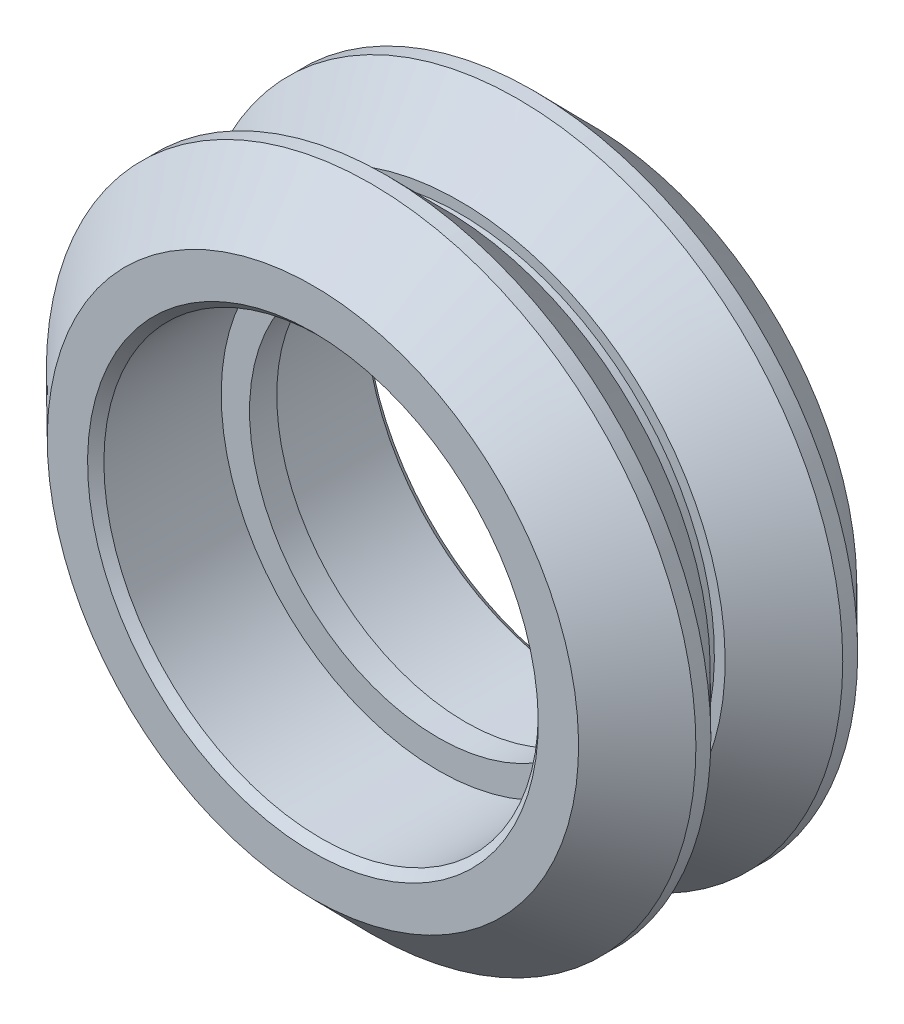
ISO-10303-21;
HEADER;
FILE_DESCRIPTION(('STEP AP214'),'2;1');
FILE_NAME('part.step','',(''),(''),'','','');
FILE_SCHEMA(('AUTOMOTIVE_DESIGN { 1 0 10303 214 1 1 1 1 }'));
ENDSEC;
DATA;
#1=APPLICATION_CONTEXT('core data for automotive mechanical design processes');
#2=APPLICATION_PROTOCOL_DEFINITION('international standard','automotive_design',2000,#1);
#3=PRODUCT_CONTEXT('',#1,'mechanical');
#4=PRODUCT('Part','Part','',(#3));
#5=PRODUCT_RELATED_PRODUCT_CATEGORY('part','',(#4));
#6=PRODUCT_DEFINITION_FORMATION('','',#4);
#7=PRODUCT_DEFINITION_CONTEXT('part definition',#1,'design');
#8=PRODUCT_DEFINITION('design','',#6,#7);
#9=PRODUCT_DEFINITION_SHAPE('','',#8);
#10=(LENGTH_UNIT() NAMED_UNIT(*) SI_UNIT(.MILLI.,.METRE.));
#11=(NAMED_UNIT(*) PLANE_ANGLE_UNIT() SI_UNIT($,.RADIAN.));
#12=(NAMED_UNIT(*) SI_UNIT($,.STERADIAN.) SOLID_ANGLE_UNIT());
#13=UNCERTAINTY_MEASURE_WITH_UNIT(LENGTH_MEASURE(1.E-05),#10,'distance_accuracy_value','');
#14=(GEOMETRIC_REPRESENTATION_CONTEXT(3) GLOBAL_UNCERTAINTY_ASSIGNED_CONTEXT((#13)) GLOBAL_UNIT_ASSIGNED_CONTEXT((#10,
#11,#12)) REPRESENTATION_CONTEXT('',''));
#15=CARTESIAN_POINT('',(0.,0.,0.));
#16=DIRECTION('',(0.,0.,1.));
#17=DIRECTION('',(1.,0.,0.));
#18=AXIS2_PLACEMENT_3D('',#15,#16,#17);
#19=CARTESIAN_POINT('',(0.,0.,5.115));
#20=DIRECTION('',(0.,0.,1.));
#21=DIRECTION('',(0.,-1.,0.));
#22=AXIS2_PLACEMENT_3D('',#19,#20,#21);
#23=CYLINDRICAL_SURFACE('',#22,7.987);
#24=CARTESIAN_POINT('',(0.,0.,4.815));
#25=DIRECTION('',(0.,0.,-1.));
#26=DIRECTION('',(0.,1.,0.));
#27=AXIS2_PLACEMENT_3D('',#24,#25,#26);
#28=CIRCLE('',#27,7.987);
#29=CARTESIAN_POINT('',(0.,7.987,4.815));
#30=VERTEX_POINT('',#29);
#31=EDGE_CURVE('E47',#30,#30,#28,.F.);
#32=ORIENTED_EDGE('',*,*,#31,.T.);
#33=EDGE_LOOP('',(#32));
#34=FACE_BOUND('',#33,.T.);
#35=CARTESIAN_POINT('',(0.,0.,0.499999999999998));
#36=DIRECTION('',(0.,0.,1.));
#37=DIRECTION('',(0.,-1.,0.));
#38=AXIS2_PLACEMENT_3D('',#35,#36,#37);
#39=CIRCLE('',#38,7.987);
#40=CARTESIAN_POINT('',(0.,-7.987,0.499999999999996));
#41=VERTEX_POINT('',#40);
#42=EDGE_CURVE('E91',#41,#41,#39,.T.);
#43=ORIENTED_EDGE('',*,*,#42,.F.);
#44=EDGE_LOOP('',(#43));
#45=FACE_BOUND('',#44,.T.);
#46=ADVANCED_FACE('F32',(#34,#45),#23,.F.);
#47=CARTESIAN_POINT('',(0.,9.77,5.115));
#48=DIRECTION('',(0.,0.,-1.));
#49=DIRECTION('',(0.,1.,0.));
#50=AXIS2_PLACEMENT_3D('',#47,#48,#49);
#51=PLANE('',#50);
#52=CARTESIAN_POINT('',(0.,0.,5.115));
#53=DIRECTION('',(0.,0.,-1.));
#54=DIRECTION('',(0.,1.,0.));
#55=AXIS2_PLACEMENT_3D('',#52,#53,#54);
#56=CIRCLE('',#55,8.287);
#57=CARTESIAN_POINT('',(0.,8.287,5.115));
#58=VERTEX_POINT('',#57);
#59=EDGE_CURVE('E43',#58,#58,#56,.T.);
#60=ORIENTED_EDGE('',*,*,#59,.T.);
#61=EDGE_LOOP('',(#60));
#62=FACE_BOUND('',#61,.T.);
#63=CARTESIAN_POINT('',(0.,0.,5.115));
#64=DIRECTION('',(0.,0.,1.));
#65=DIRECTION('',(0.,-1.,0.));
#66=AXIS2_PLACEMENT_3D('',#63,#64,#65);
#67=CIRCLE('',#66,9.77);
#68=CARTESIAN_POINT('',(0.,-9.77,5.115));
#69=VERTEX_POINT('',#68);
#70=EDGE_CURVE('E52',#69,#69,#67,.T.);
#71=ORIENTED_EDGE('',*,*,#70,.T.);
#72=EDGE_LOOP('',(#71));
#73=FACE_BOUND('',#72,.T.);
#74=ADVANCED_FACE('F98',(#62,#73),#51,.F.);
#75=CARTESIAN_POINT('',(0.,0.,2.975));
#76=DIRECTION('',(0.,0.,-1.));
#77=DIRECTION('',(0.,1.,0.));
#78=AXIS2_PLACEMENT_3D('',#75,#76,#77);
#79=CONICAL_SURFACE('',#78,11.945,0.79350922537995);
#80=ORIENTED_EDGE('',*,*,#70,.F.);
#81=EDGE_LOOP('',(#80));
#82=FACE_BOUND('',#81,.T.);
#83=CARTESIAN_POINT('',(0.,0.,2.975));
#84=DIRECTION('',(0.,0.,1.));
#85=DIRECTION('',(0.,-1.,0.));
#86=AXIS2_PLACEMENT_3D('',#83,#84,#85);
#87=CIRCLE('',#86,11.945);
#88=CARTESIAN_POINT('',(0.,-11.945,2.975));
#89=VERTEX_POINT('',#88);
#90=EDGE_CURVE('E55',#89,#89,#87,.T.);
#91=ORIENTED_EDGE('',*,*,#90,.T.);
#92=EDGE_LOOP('',(#91));
#93=FACE_BOUND('',#92,.T.);
#94=ADVANCED_FACE('F104',(#82,#93),#79,.T.);
#95=CARTESIAN_POINT('',(0.,0.,5.115));
#96=DIRECTION('',(0.,0.,1.));
#97=DIRECTION('',(0.,-1.,0.));
#98=AXIS2_PLACEMENT_3D('',#95,#96,#97);
#99=CYLINDRICAL_SURFACE('',#98,11.945);
#100=ORIENTED_EDGE('',*,*,#90,.F.);
#101=EDGE_LOOP('',(#100));
#102=FACE_BOUND('',#101,.T.);
#103=CARTESIAN_POINT('',(0.,0.,2.425));
#104=DIRECTION('',(0.,0.,1.));
#105=DIRECTION('',(0.,-1.,0.));
#106=AXIS2_PLACEMENT_3D('',#103,#104,#105);
#107=CIRCLE('',#106,11.945);
#108=CARTESIAN_POINT('',(0.,-11.945,2.425));
#109=VERTEX_POINT('',#108);
#110=EDGE_CURVE('E58',#109,#109,#107,.T.);
#111=ORIENTED_EDGE('',*,*,#110,.T.);
#112=EDGE_LOOP('',(#111));
#113=FACE_BOUND('',#112,.T.);
#114=ADVANCED_FACE('F127',(#102,#113),#99,.T.);
#115=CARTESIAN_POINT('',(0.,0.,0.274999999999998));
#116=DIRECTION('',(0.,0.,1.));
#117=DIRECTION('',(0.,-1.,0.));
#118=AXIS2_PLACEMENT_3D('',#115,#116,#117);
#119=CONICAL_SURFACE('',#118,9.77,0.791178445841111);
#120=ORIENTED_EDGE('',*,*,#110,.F.);
#121=EDGE_LOOP('',(#120));
#122=FACE_BOUND('',#121,.T.);
#123=CARTESIAN_POINT('',(0.,0.,0.274999999999998));
#124=DIRECTION('',(0.,0.,1.));
#125=DIRECTION('',(0.,-1.,0.));
#126=AXIS2_PLACEMENT_3D('',#123,#124,#125);
#127=CIRCLE('',#126,9.77);
#128=CARTESIAN_POINT('',(0.,-9.77,0.274999999999997));
#129=VERTEX_POINT('',#128);
#130=EDGE_CURVE('E61',#129,#129,#127,.T.);
#131=ORIENTED_EDGE('',*,*,#130,.T.);
#132=EDGE_LOOP('',(#131));
#133=FACE_BOUND('',#132,.T.);
#134=ADVANCED_FACE('F132',(#122,#133),#119,.T.);
#135=CARTESIAN_POINT('',(0.,9.77,0.275));
#136=DIRECTION('',(0.,0.,1.));
#137=DIRECTION('',(0.,-1.,0.));
#138=AXIS2_PLACEMENT_3D('',#135,#136,#137);
#139=PLANE('',#138);
#140=ORIENTED_EDGE('',*,*,#130,.F.);
#141=EDGE_LOOP('',(#140));
#142=FACE_BOUND('',#141,.T.);
#143=CARTESIAN_POINT('',(0.,0.,0.274999999999998));
#144=DIRECTION('',(0.,0.,1.));
#145=DIRECTION('',(0.,-1.,0.));
#146=AXIS2_PLACEMENT_3D('',#143,#144,#145);
#147=CIRCLE('',#146,9.375);
#148=CARTESIAN_POINT('',(0.,-9.375,0.274999999999997));
#149=VERTEX_POINT('',#148);
#150=EDGE_CURVE('E64',#149,#149,#147,.T.);
#151=ORIENTED_EDGE('',*,*,#150,.T.);
#152=EDGE_LOOP('',(#151));
#153=FACE_BOUND('',#152,.T.);
#154=ADVANCED_FACE('F138',(#142,#153),#139,.F.);
#155=CARTESIAN_POINT('',(0.,0.,5.115));
#156=DIRECTION('',(0.,0.,1.));
#157=DIRECTION('',(0.,-1.,0.));
#158=AXIS2_PLACEMENT_3D('',#155,#156,#157);
#159=CYLINDRICAL_SURFACE('',#158,9.375);
#160=ORIENTED_EDGE('',*,*,#150,.F.);
#161=EDGE_LOOP('',(#160));
#162=FACE_BOUND('',#161,.T.);
#163=CARTESIAN_POINT('',(0.,0.,-0.275000000000002));
#164=DIRECTION('',(0.,0.,1.));
#165=DIRECTION('',(0.,-1.,0.));
#166=AXIS2_PLACEMENT_3D('',#163,#164,#165);
#167=CIRCLE('',#166,9.375);
#168=CARTESIAN_POINT('',(0.,-9.375,-0.275000000000004));
#169=VERTEX_POINT('',#168);
#170=EDGE_CURVE('E67',#169,#169,#167,.T.);
#171=ORIENTED_EDGE('',*,*,#170,.T.);
#172=EDGE_LOOP('',(#171));
#173=FACE_BOUND('',#172,.T.);
#174=ADVANCED_FACE('F144',(#162,#173),#159,.T.);
#175=CARTESIAN_POINT('',(0.,9.77,-0.275));
#176=DIRECTION('',(0.,0.,-1.));
#177=DIRECTION('',(0.,1.,0.));
#178=AXIS2_PLACEMENT_3D('',#175,#176,#177);
#179=PLANE('',#178);
#180=ORIENTED_EDGE('',*,*,#170,.F.);
#181=EDGE_LOOP('',(#180));
#182=FACE_BOUND('',#181,.T.);
#183=CARTESIAN_POINT('',(0.,0.,-0.275000000000002));
#184=DIRECTION('',(0.,0.,1.));
#185=DIRECTION('',(0.,-1.,0.));
#186=AXIS2_PLACEMENT_3D('',#183,#184,#185);
#187=CIRCLE('',#186,9.77);
#188=CARTESIAN_POINT('',(0.,-9.77,-0.275000000000004));
#189=VERTEX_POINT('',#188);
#190=EDGE_CURVE('E70',#189,#189,#187,.T.);
#191=ORIENTED_EDGE('',*,*,#190,.T.);
#192=EDGE_LOOP('',(#191));
#193=FACE_BOUND('',#192,.T.);
#194=ADVANCED_FACE('F150',(#182,#193),#179,.F.);
#195=CARTESIAN_POINT('',(0.,0.,-2.425));
#196=DIRECTION('',(0.,0.,-1.));
#197=DIRECTION('',(0.,1.,0.));
#198=AXIS2_PLACEMENT_3D('',#195,#196,#197);
#199=CONICAL_SURFACE('',#198,11.945,0.791178445841111);
#200=ORIENTED_EDGE('',*,*,#190,.F.);
#201=EDGE_LOOP('',(#200));
#202=FACE_BOUND('',#201,.T.);
#203=CARTESIAN_POINT('',(0.,0.,-2.425));
#204=DIRECTION('',(0.,0.,1.));
#205=DIRECTION('',(0.,-1.,0.));
#206=AXIS2_PLACEMENT_3D('',#203,#204,#205);
#207=CIRCLE('',#206,11.945);
#208=CARTESIAN_POINT('',(0.,-11.945,-2.425));
#209=VERTEX_POINT('',#208);
#210=EDGE_CURVE('E73',#209,#209,#207,.T.);
#211=ORIENTED_EDGE('',*,*,#210,.T.);
#212=EDGE_LOOP('',(#211));
#213=FACE_BOUND('',#212,.T.);
#214=ADVANCED_FACE('F156',(#202,#213),#199,.T.);
#215=CARTESIAN_POINT('',(0.,0.,5.115));
#216=DIRECTION('',(0.,0.,1.));
#217=DIRECTION('',(0.,-1.,0.));
#218=AXIS2_PLACEMENT_3D('',#215,#216,#217);
#219=CYLINDRICAL_SURFACE('',#218,11.945);
#220=ORIENTED_EDGE('',*,*,#210,.F.);
#221=EDGE_LOOP('',(#220));
#222=FACE_BOUND('',#221,.T.);
#223=CARTESIAN_POINT('',(0.,0.,-2.975));
#224=DIRECTION('',(0.,0.,1.));
#225=DIRECTION('',(0.,-1.,0.));
#226=AXIS2_PLACEMENT_3D('',#223,#224,#225);
#227=CIRCLE('',#226,11.945);
#228=CARTESIAN_POINT('',(0.,-11.945,-2.975));
#229=VERTEX_POINT('',#228);
#230=EDGE_CURVE('E76',#229,#229,#227,.T.);
#231=ORIENTED_EDGE('',*,*,#230,.T.);
#232=EDGE_LOOP('',(#231));
#233=FACE_BOUND('',#232,.T.);
#234=ADVANCED_FACE('F162',(#222,#233),#219,.T.);
#235=CARTESIAN_POINT('',(0.,0.,-5.115));
#236=DIRECTION('',(0.,0.,1.));
#237=DIRECTION('',(0.,-1.,0.));
#238=AXIS2_PLACEMENT_3D('',#235,#236,#237);
#239=CONICAL_SURFACE('',#238,9.77,0.79350922537995);
#240=ORIENTED_EDGE('',*,*,#230,.F.);
#241=EDGE_LOOP('',(#240));
#242=FACE_BOUND('',#241,.T.);
#243=CARTESIAN_POINT('',(0.,0.,-5.115));
#244=DIRECTION('',(0.,0.,1.));
#245=DIRECTION('',(0.,-1.,0.));
#246=AXIS2_PLACEMENT_3D('',#243,#244,#245);
#247=CIRCLE('',#246,9.77);
#248=CARTESIAN_POINT('',(0.,-9.77,-5.115));
#249=VERTEX_POINT('',#248);
#250=EDGE_CURVE('E79',#249,#249,#247,.T.);
#251=ORIENTED_EDGE('',*,*,#250,.T.);
#252=EDGE_LOOP('',(#251));
#253=FACE_BOUND('',#252,.T.);
#254=ADVANCED_FACE('F168',(#242,#253),#239,.T.);
#255=CARTESIAN_POINT('',(0.,9.77,-5.115));
#256=DIRECTION('',(0.,0.,1.));
#257=DIRECTION('',(0.,-1.,0.));
#258=AXIS2_PLACEMENT_3D('',#255,#256,#257);
#259=PLANE('',#258);
#260=CARTESIAN_POINT('',(0.,0.,-5.115));
#261=DIRECTION('',(0.,0.,1.));
#262=DIRECTION('',(0.,-1.,0.));
#263=AXIS2_PLACEMENT_3D('',#260,#261,#262);
#264=CIRCLE('',#263,8.28700000000001);
#265=CARTESIAN_POINT('',(0.,-8.287,-5.115));
#266=VERTEX_POINT('',#265);
#267=EDGE_CURVE('E39',#266,#266,#264,.T.);
#268=ORIENTED_EDGE('',*,*,#267,.T.);
#269=EDGE_LOOP('',(#268));
#270=FACE_BOUND('',#269,.T.);
#271=ORIENTED_EDGE('',*,*,#250,.F.);
#272=EDGE_LOOP('',(#271));
#273=FACE_BOUND('',#272,.T.);
#274=ADVANCED_FACE('F174',(#270,#273),#259,.F.);
#275=CARTESIAN_POINT('',(0.,0.,5.115));
#276=DIRECTION('',(0.,0.,1.));
#277=DIRECTION('',(0.,-1.,0.));
#278=AXIS2_PLACEMENT_3D('',#275,#276,#277);
#279=CYLINDRICAL_SURFACE('',#278,7.987);
#280=CARTESIAN_POINT('',(0.,0.,-4.815));
#281=DIRECTION('',(0.,0.,1.));
#282=DIRECTION('',(0.,-1.,0.));
#283=AXIS2_PLACEMENT_3D('',#280,#281,#282);
#284=CIRCLE('',#283,7.987);
#285=CARTESIAN_POINT('',(0.,-7.987,-4.815));
#286=VERTEX_POINT('',#285);
#287=EDGE_CURVE('E10',#286,#286,#284,.F.);
#288=ORIENTED_EDGE('',*,*,#287,.T.);
#289=EDGE_LOOP('',(#288));
#290=FACE_BOUND('',#289,.T.);
#291=CARTESIAN_POINT('',(0.,0.,-0.500000000000001));
#292=DIRECTION('',(0.,0.,1.));
#293=DIRECTION('',(0.,-1.,0.));
#294=AXIS2_PLACEMENT_3D('',#291,#292,#293);
#295=CIRCLE('',#294,7.987);
#296=CARTESIAN_POINT('',(0.,-7.987,-0.500000000000003));
#297=VERTEX_POINT('',#296);
#298=EDGE_CURVE('E82',#297,#297,#295,.T.);
#299=ORIENTED_EDGE('',*,*,#298,.T.);
#300=EDGE_LOOP('',(#299));
#301=FACE_BOUND('',#300,.T.);
#302=ADVANCED_FACE('F179',(#290,#301),#279,.F.);
#303=CARTESIAN_POINT('',(0.,7.987,-0.5));
#304=DIRECTION('',(0.,0.,1.));
#305=DIRECTION('',(0.,-1.,0.));
#306=AXIS2_PLACEMENT_3D('',#303,#304,#305);
#307=PLANE('',#306);
#308=ORIENTED_EDGE('',*,*,#298,.F.);
#309=EDGE_LOOP('',(#308));
#310=FACE_BOUND('',#309,.T.);
#311=CARTESIAN_POINT('',(0.,0.,-0.500000000000002));
#312=DIRECTION('',(0.,0.,1.));
#313=DIRECTION('',(0.,-1.,0.));
#314=AXIS2_PLACEMENT_3D('',#311,#312,#313);
#315=CIRCLE('',#314,6.945);
#316=CARTESIAN_POINT('',(0.,-6.945,-0.500000000000003));
#317=VERTEX_POINT('',#316);
#318=EDGE_CURVE('E85',#317,#317,#315,.T.);
#319=ORIENTED_EDGE('',*,*,#318,.T.);
#320=EDGE_LOOP('',(#319));
#321=FACE_BOUND('',#320,.T.);
#322=ADVANCED_FACE('F184',(#310,#321),#307,.F.);
#323=CARTESIAN_POINT('',(0.,0.,5.115));
#324=DIRECTION('',(0.,0.,1.));
#325=DIRECTION('',(0.,-1.,0.));
#326=AXIS2_PLACEMENT_3D('',#323,#324,#325);
#327=CYLINDRICAL_SURFACE('',#326,6.945);
#328=ORIENTED_EDGE('',*,*,#318,.F.);
#329=EDGE_LOOP('',(#328));
#330=FACE_BOUND('',#329,.T.);
#331=CARTESIAN_POINT('',(0.,0.,0.499999999999999));
#332=DIRECTION('',(0.,0.,1.));
#333=DIRECTION('',(0.,-1.,0.));
#334=AXIS2_PLACEMENT_3D('',#331,#332,#333);
#335=CIRCLE('',#334,6.945);
#336=CARTESIAN_POINT('',(0.,-6.945,0.499999999999997));
#337=VERTEX_POINT('',#336);
#338=EDGE_CURVE('E88',#337,#337,#335,.T.);
#339=ORIENTED_EDGE('',*,*,#338,.T.);
#340=EDGE_LOOP('',(#339));
#341=FACE_BOUND('',#340,.T.);
#342=ADVANCED_FACE('F116',(#330,#341),#327,.F.);
#343=CARTESIAN_POINT('',(0.,7.987,0.5));
#344=DIRECTION('',(0.,0.,-1.));
#345=DIRECTION('',(0.,1.,0.));
#346=AXIS2_PLACEMENT_3D('',#343,#344,#345);
#347=PLANE('',#346);
#348=ORIENTED_EDGE('',*,*,#338,.F.);
#349=EDGE_LOOP('',(#348));
#350=FACE_BOUND('',#349,.T.);
#351=ORIENTED_EDGE('',*,*,#42,.T.);
#352=EDGE_LOOP('',(#351));
#353=FACE_BOUND('',#352,.T.);
#354=ADVANCED_FACE('F95',(#350,#353),#347,.F.);
#355=CARTESIAN_POINT('',(0.,0.,4.815));
#356=DIRECTION('',(0.,0.,1.));
#357=DIRECTION('',(0.,-1.,0.));
#358=AXIS2_PLACEMENT_3D('',#355,#356,#357);
#359=CONICAL_SURFACE('',#358,7.987,0.78539816339746);
#360=ORIENTED_EDGE('',*,*,#59,.F.);
#361=EDGE_LOOP('',(#360));
#362=FACE_BOUND('',#361,.T.);
#363=ORIENTED_EDGE('',*,*,#31,.F.);
#364=EDGE_LOOP('',(#363));
#365=FACE_BOUND('',#364,.T.);
#366=ADVANCED_FACE('F108',(#362,#365),#359,.F.);
#367=CARTESIAN_POINT('',(0.,0.,-5.115));
#368=DIRECTION('',(0.,0.,-1.));
#369=DIRECTION('',(0.,1.,0.));
#370=AXIS2_PLACEMENT_3D('',#367,#368,#369);
#371=CONICAL_SURFACE('',#370,8.28700000000001,0.785398163397448);
#372=ORIENTED_EDGE('',*,*,#287,.F.);
#373=EDGE_LOOP('',(#372));
#374=FACE_BOUND('',#373,.T.);
#375=ORIENTED_EDGE('',*,*,#267,.F.);
#376=EDGE_LOOP('',(#375));
#377=FACE_BOUND('',#376,.T.);
#378=ADVANCED_FACE('F34',(#374,#377),#371,.F.);
#379=CLOSED_SHELL('',(#46,#74,#94,#114,#134,#154,#174,#194,#214,#234,#254,#274,#302,#322,#342,
#354,#366,#378));
#380=MANIFOLD_SOLID_BREP('B2',#379);
#381=ADVANCED_BREP_SHAPE_REPRESENTATION('',(#18,#380),#14);
#382=SHAPE_DEFINITION_REPRESENTATION(#9,#381);
ENDSEC;
END-ISO-10303-21;
